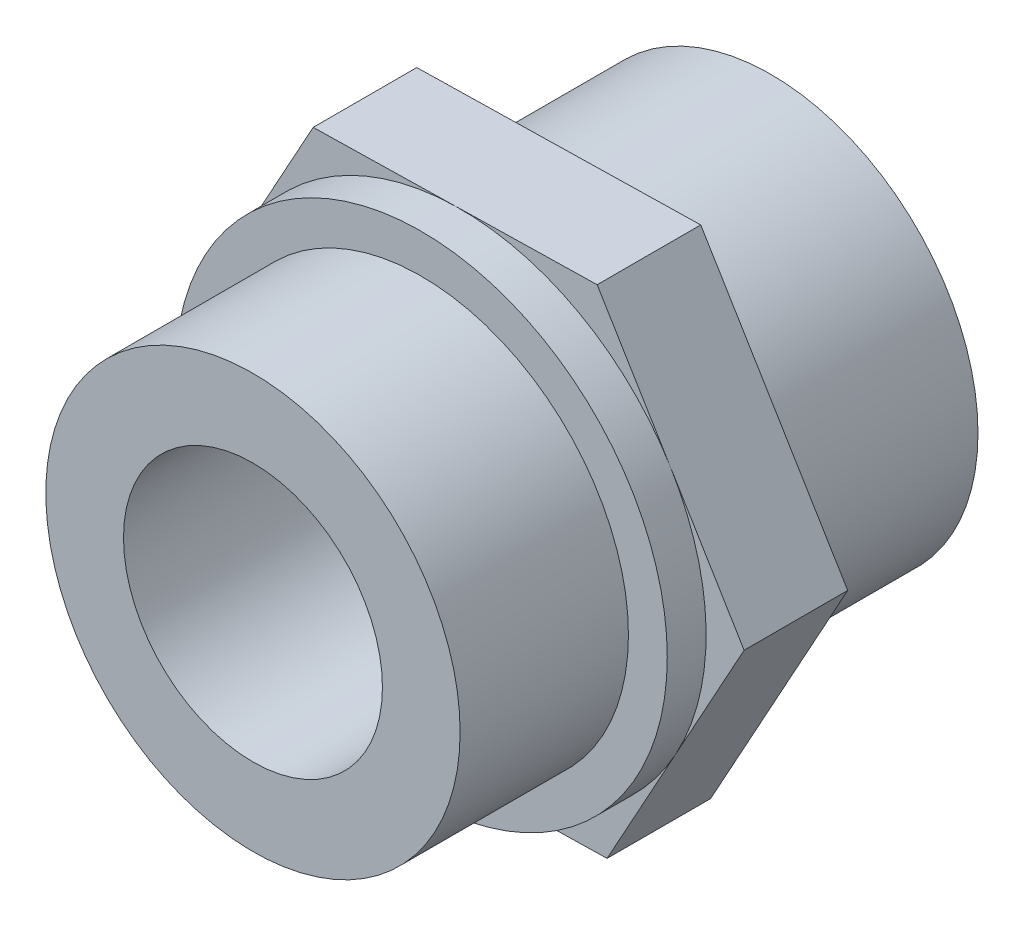
ISO-10303-21;
HEADER;
FILE_DESCRIPTION(('STEP AP214'),'2;1');
FILE_NAME('part.step','',(''),(''),'','','');
FILE_SCHEMA(('AUTOMOTIVE_DESIGN { 1 0 10303 214 1 1 1 1 }'));
ENDSEC;
DATA;
#1=APPLICATION_CONTEXT('core data for automotive mechanical design processes');
#2=APPLICATION_PROTOCOL_DEFINITION('international standard','automotive_design',2000,#1);
#3=PRODUCT_CONTEXT('',#1,'mechanical');
#4=PRODUCT('Part','Part','',(#3));
#5=PRODUCT_RELATED_PRODUCT_CATEGORY('part','',(#4));
#6=PRODUCT_DEFINITION_FORMATION('','',#4);
#7=PRODUCT_DEFINITION_CONTEXT('part definition',#1,'design');
#8=PRODUCT_DEFINITION('design','',#6,#7);
#9=PRODUCT_DEFINITION_SHAPE('','',#8);
#10=(LENGTH_UNIT() NAMED_UNIT(*) SI_UNIT(.MILLI.,.METRE.));
#11=(NAMED_UNIT(*) PLANE_ANGLE_UNIT() SI_UNIT($,.RADIAN.));
#12=(NAMED_UNIT(*) SI_UNIT($,.STERADIAN.) SOLID_ANGLE_UNIT());
#13=UNCERTAINTY_MEASURE_WITH_UNIT(LENGTH_MEASURE(1.E-05),#10,'distance_accuracy_value','');
#14=(GEOMETRIC_REPRESENTATION_CONTEXT(3) GLOBAL_UNCERTAINTY_ASSIGNED_CONTEXT((#13)) GLOBAL_UNIT_ASSIGNED_CONTEXT((#10,
#11,#12)) REPRESENTATION_CONTEXT('',''));
#15=CARTESIAN_POINT('',(0.,0.,0.));
#16=DIRECTION('',(0.,0.,1.));
#17=DIRECTION('',(1.,0.,0.));
#18=AXIS2_PLACEMENT_3D('',#15,#16,#17);
#19=CARTESIAN_POINT('',(0.,0.,4.));
#20=DIRECTION('',(0.,0.,1.));
#21=DIRECTION('',(1.,0.,0.));
#22=AXIS2_PLACEMENT_3D('',#19,#20,#21);
#23=PLANE('',#22);
#24=DIRECTION('',(0.482451119967932,0.875922894347264,0.));
#25=VECTOR('',#24,1.);
#26=CARTESIAN_POINT('',(5.67510629844794,-9.38757166868247,4.));
#27=LINE('',#26,#25);
#28=CARTESIAN_POINT('',(5.67510629844794,-9.38757166868247,4.));
#29=VERTEX_POINT('',#28);
#30=CARTESIAN_POINT('',(8.321267496299,-4.58328563969536,4.));
#31=VERTEX_POINT('',#30);
#32=EDGE_CURVE('E205',#29,#31,#27,.T.);
#33=ORIENTED_EDGE('',*,*,#32,.T.);
#34=CARTESIAN_POINT('',(0.,0.,4.));
#35=DIRECTION('',(0.,0.,1.));
#36=DIRECTION('',(1.,0.,0.));
#37=AXIS2_PLACEMENT_3D('',#34,#35,#36);
#38=CIRCLE('',#37,9.5);
#39=CARTESIAN_POINT('',(0.191391951372911,-9.49807186332835,4.));
#40=VERTEX_POINT('',#39);
#41=EDGE_CURVE('E57',#40,#31,#38,.T.);
#42=ORIENTED_EDGE('',*,*,#41,.F.);
#43=DIRECTION('',(0.999797038245089,0.0201465211971485,0.));
#44=VECTOR('',#43,1.);
#45=CARTESIAN_POINT('',(-5.29232239570213,-9.60857205797423,4.));
#46=LINE('',#45,#44);
#47=EDGE_CURVE('E102',#40,#29,#46,.T.);
#48=ORIENTED_EDGE('',*,*,#47,.T.);
#49=EDGE_LOOP('',(#33,#42,#48));
#50=FACE_BOUND('',#49,.T.);
#51=ADVANCED_FACE('F41',(#50),#23,.T.);
#52=CARTESIAN_POINT('',(-5.29232239570213,-9.60857205797423,4.));
#53=VERTEX_POINT('',#52);
#54=EDGE_CURVE('E210',#53,#40,#46,.T.);
#55=ORIENTED_EDGE('',*,*,#54,.T.);
#56=CARTESIAN_POINT('',(-8.12987554492609,-4.91478622363299,4.));
#57=VERTEX_POINT('',#56);
#58=EDGE_CURVE('E421',#57,#40,#38,.T.);
#59=ORIENTED_EDGE('',*,*,#58,.F.);
#60=DIRECTION('',(0.517345918277157,-0.855776373150115,0.));
#61=VECTOR('',#60,1.);
#62=CARTESIAN_POINT('',(-10.9674286941501,-0.221000389291756,4.));
#63=LINE('',#62,#61);
#64=EDGE_CURVE('E66',#57,#53,#63,.T.);
#65=ORIENTED_EDGE('',*,*,#64,.T.);
#66=EDGE_LOOP('',(#55,#59,#65));
#67=FACE_BOUND('',#66,.T.);
#68=ADVANCED_FACE('F250',(#67),#23,.T.);
#69=CARTESIAN_POINT('',(-10.9674286941501,-0.221000389291756,4.));
#70=VERTEX_POINT('',#69);
#71=EDGE_CURVE('E147',#70,#57,#63,.T.);
#72=ORIENTED_EDGE('',*,*,#71,.T.);
#73=CARTESIAN_POINT('',(-8.321267496299,4.58328563969536,4.));
#74=VERTEX_POINT('',#73);
#75=EDGE_CURVE('E189',#74,#57,#38,.T.);
#76=ORIENTED_EDGE('',*,*,#75,.F.);
#77=DIRECTION('',(-0.482451119967932,-0.875922894347264,0.));
#78=VECTOR('',#77,1.);
#79=CARTESIAN_POINT('',(-5.67510629844794,9.38757166868247,4.));
#80=LINE('',#79,#78);
#81=EDGE_CURVE('E145',#74,#70,#80,.T.);
#82=ORIENTED_EDGE('',*,*,#81,.T.);
#83=EDGE_LOOP('',(#72,#76,#82));
#84=FACE_BOUND('',#83,.T.);
#85=ADVANCED_FACE('F187',(#84),#23,.T.);
#86=CARTESIAN_POINT('',(-5.67510629844794,9.38757166868247,4.));
#87=VERTEX_POINT('',#86);
#88=EDGE_CURVE('E121',#87,#74,#80,.T.);
#89=ORIENTED_EDGE('',*,*,#88,.T.);
#90=CARTESIAN_POINT('',(-0.191391951372911,9.49807186332835,4.));
#91=VERTEX_POINT('',#90);
#92=EDGE_CURVE('E124',#91,#74,#38,.T.);
#93=ORIENTED_EDGE('',*,*,#92,.F.);
#94=DIRECTION('',(-0.999797038245089,-0.0201465211971485,0.));
#95=VECTOR('',#94,1.);
#96=CARTESIAN_POINT('',(5.29232239570212,9.60857205797423,4.));
#97=LINE('',#96,#95);
#98=EDGE_CURVE('E116',#91,#87,#97,.T.);
#99=ORIENTED_EDGE('',*,*,#98,.T.);
#100=EDGE_LOOP('',(#89,#93,#99));
#101=FACE_BOUND('',#100,.T.);
#102=ADVANCED_FACE('F118',(#101),#23,.T.);
#103=CARTESIAN_POINT('',(5.29232239570212,9.60857205797423,4.));
#104=VERTEX_POINT('',#103);
#105=EDGE_CURVE('E128',#104,#91,#97,.T.);
#106=ORIENTED_EDGE('',*,*,#105,.T.);
#107=CARTESIAN_POINT('',(8.12987554492609,4.91478622363299,4.));
#108=VERTEX_POINT('',#107);
#109=EDGE_CURVE('E198',#108,#91,#38,.T.);
#110=ORIENTED_EDGE('',*,*,#109,.F.);
#111=DIRECTION('',(-0.517345918277157,0.855776373150115,0.));
#112=VECTOR('',#111,1.);
#113=CARTESIAN_POINT('',(10.9674286941501,0.221000389291757,4.));
#114=LINE('',#113,#112);
#115=EDGE_CURVE('E203',#108,#104,#114,.T.);
#116=ORIENTED_EDGE('',*,*,#115,.T.);
#117=EDGE_LOOP('',(#106,#110,#116));
#118=FACE_BOUND('',#117,.T.);
#119=ADVANCED_FACE('F202',(#118),#23,.T.);
#120=CARTESIAN_POINT('',(-5.29232239570213,-9.60857205797423,4.));
#121=DIRECTION('',(-0.0201465211971485,0.99979703824509,0.));
#122=DIRECTION('',(-0.99979703824509,-0.0201465211971485,0.));
#123=AXIS2_PLACEMENT_3D('',#120,#121,#122);
#124=PLANE('',#123);
#125=DIRECTION('',(0.999797038245089,0.0201465211971485,0.));
#126=VECTOR('',#125,1.);
#127=CARTESIAN_POINT('',(-5.29232239570213,-9.60857205797423,0.));
#128=LINE('',#127,#126);
#129=CARTESIAN_POINT('',(-5.29232239570213,-9.60857205797423,0.));
#130=VERTEX_POINT('',#129);
#131=CARTESIAN_POINT('',(5.67510629844794,-9.38757166868247,0.));
#132=VERTEX_POINT('',#131);
#133=EDGE_CURVE('E153',#130,#132,#128,.T.);
#134=ORIENTED_EDGE('',*,*,#133,.T.);
#135=DIRECTION('',(0.,0.,-1.));
#136=VECTOR('',#135,1.);
#137=CARTESIAN_POINT('',(5.67510629844794,-9.38757166868247,4.));
#138=LINE('',#137,#136);
#139=EDGE_CURVE('E11',#29,#132,#138,.T.);
#140=ORIENTED_EDGE('',*,*,#139,.F.);
#141=ORIENTED_EDGE('',*,*,#47,.F.);
#142=ORIENTED_EDGE('',*,*,#54,.F.);
#143=DIRECTION('',(0.,0.,-1.));
#144=VECTOR('',#143,1.);
#145=CARTESIAN_POINT('',(-5.29232239570213,-9.60857205797423,4.));
#146=LINE('',#145,#144);
#147=EDGE_CURVE('E152',#53,#130,#146,.T.);
#148=ORIENTED_EDGE('',*,*,#147,.T.);
#149=EDGE_LOOP('',(#134,#140,#141,#142,#148));
#150=FACE_BOUND('',#149,.T.);
#151=ADVANCED_FACE('F43',(#150),#124,.F.);
#152=CARTESIAN_POINT('',(5.67510629844794,-9.38757166868247,4.));
#153=DIRECTION('',(-0.875922894347264,0.482451119967932,0.));
#154=DIRECTION('',(-0.482451119967932,-0.875922894347264,0.));
#155=AXIS2_PLACEMENT_3D('',#152,#153,#154);
#156=PLANE('',#155);
#157=DIRECTION('',(0.482451119967932,0.875922894347264,0.));
#158=VECTOR('',#157,1.);
#159=CARTESIAN_POINT('',(5.67510629844794,-9.38757166868247,0.));
#160=LINE('',#159,#158);
#161=CARTESIAN_POINT('',(10.9674286941501,0.221000389291757,0.));
#162=VERTEX_POINT('',#161);
#163=EDGE_CURVE('E156',#132,#162,#160,.T.);
#164=ORIENTED_EDGE('',*,*,#163,.T.);
#165=DIRECTION('',(0.,0.,-1.));
#166=VECTOR('',#165,1.);
#167=CARTESIAN_POINT('',(10.9674286941501,0.221000389291757,4.));
#168=LINE('',#167,#166);
#169=CARTESIAN_POINT('',(10.9674286941501,0.221000389291757,4.));
#170=VERTEX_POINT('',#169);
#171=EDGE_CURVE('E50',#170,#162,#168,.T.);
#172=ORIENTED_EDGE('',*,*,#171,.F.);
#173=EDGE_CURVE('E207',#31,#170,#27,.T.);
#174=ORIENTED_EDGE('',*,*,#173,.F.);
#175=ORIENTED_EDGE('',*,*,#32,.F.);
#176=ORIENTED_EDGE('',*,*,#139,.T.);
#177=EDGE_LOOP('',(#164,#172,#174,#175,#176));
#178=FACE_BOUND('',#177,.T.);
#179=ADVANCED_FACE('F269',(#178),#156,.F.);
#180=CARTESIAN_POINT('',(10.9674286941501,0.221000389291757,4.));
#181=DIRECTION('',(-0.855776373150115,-0.517345918277157,0.));
#182=DIRECTION('',(0.517345918277157,-0.855776373150115,0.));
#183=AXIS2_PLACEMENT_3D('',#180,#181,#182);
#184=PLANE('',#183);
#185=DIRECTION('',(-0.517345918277157,0.855776373150115,0.));
#186=VECTOR('',#185,1.);
#187=CARTESIAN_POINT('',(10.9674286941501,0.221000389291757,0.));
#188=LINE('',#187,#186);
#189=CARTESIAN_POINT('',(5.29232239570212,9.60857205797423,0.));
#190=VERTEX_POINT('',#189);
#191=EDGE_CURVE('E159',#162,#190,#188,.T.);
#192=ORIENTED_EDGE('',*,*,#191,.T.);
#193=DIRECTION('',(0.,0.,-1.));
#194=VECTOR('',#193,1.);
#195=CARTESIAN_POINT('',(5.29232239570212,9.60857205797423,4.));
#196=LINE('',#195,#194);
#197=EDGE_CURVE('E139',#104,#190,#196,.T.);
#198=ORIENTED_EDGE('',*,*,#197,.F.);
#199=ORIENTED_EDGE('',*,*,#115,.F.);
#200=EDGE_CURVE('E129',#170,#108,#114,.T.);
#201=ORIENTED_EDGE('',*,*,#200,.F.);
#202=ORIENTED_EDGE('',*,*,#171,.T.);
#203=EDGE_LOOP('',(#192,#198,#199,#201,#202));
#204=FACE_BOUND('',#203,.T.);
#205=ADVANCED_FACE('F173',(#204),#184,.F.);
#206=CARTESIAN_POINT('',(5.29232239570212,9.60857205797423,4.));
#207=DIRECTION('',(0.0201465211971485,-0.99979703824509,0.));
#208=DIRECTION('',(0.99979703824509,0.0201465211971485,0.));
#209=AXIS2_PLACEMENT_3D('',#206,#207,#208);
#210=PLANE('',#209);
#211=DIRECTION('',(-0.999797038245089,-0.0201465211971485,0.));
#212=VECTOR('',#211,1.);
#213=CARTESIAN_POINT('',(5.29232239570212,9.60857205797423,0.));
#214=LINE('',#213,#212);
#215=CARTESIAN_POINT('',(-5.67510629844794,9.38757166868247,0.));
#216=VERTEX_POINT('',#215);
#217=EDGE_CURVE('E136',#190,#216,#214,.T.);
#218=ORIENTED_EDGE('',*,*,#217,.T.);
#219=DIRECTION('',(0.,0.,-1.));
#220=VECTOR('',#219,1.);
#221=CARTESIAN_POINT('',(-5.67510629844794,9.38757166868247,4.));
#222=LINE('',#221,#220);
#223=EDGE_CURVE('E132',#87,#216,#222,.T.);
#224=ORIENTED_EDGE('',*,*,#223,.F.);
#225=ORIENTED_EDGE('',*,*,#98,.F.);
#226=ORIENTED_EDGE('',*,*,#105,.F.);
#227=ORIENTED_EDGE('',*,*,#197,.T.);
#228=EDGE_LOOP('',(#218,#224,#225,#226,#227));
#229=FACE_BOUND('',#228,.T.);
#230=ADVANCED_FACE('F133',(#229),#210,.F.);
#231=CARTESIAN_POINT('',(-5.67510629844794,9.38757166868247,4.));
#232=DIRECTION('',(0.875922894347264,-0.482451119967932,0.));
#233=DIRECTION('',(0.482451119967932,0.875922894347264,0.));
#234=AXIS2_PLACEMENT_3D('',#231,#232,#233);
#235=PLANE('',#234);
#236=DIRECTION('',(-0.482451119967932,-0.875922894347264,0.));
#237=VECTOR('',#236,1.);
#238=CARTESIAN_POINT('',(-5.67510629844794,9.38757166868247,0.));
#239=LINE('',#238,#237);
#240=CARTESIAN_POINT('',(-10.9674286941501,-0.221000389291756,0.));
#241=VERTEX_POINT('',#240);
#242=EDGE_CURVE('E162',#216,#241,#239,.T.);
#243=ORIENTED_EDGE('',*,*,#242,.T.);
#244=DIRECTION('',(0.,0.,-1.));
#245=VECTOR('',#244,1.);
#246=CARTESIAN_POINT('',(-10.9674286941501,-0.221000389291756,4.));
#247=LINE('',#246,#245);
#248=EDGE_CURVE('E140',#70,#241,#247,.T.);
#249=ORIENTED_EDGE('',*,*,#248,.F.);
#250=ORIENTED_EDGE('',*,*,#81,.F.);
#251=ORIENTED_EDGE('',*,*,#88,.F.);
#252=ORIENTED_EDGE('',*,*,#223,.T.);
#253=EDGE_LOOP('',(#243,#249,#250,#251,#252));
#254=FACE_BOUND('',#253,.T.);
#255=ADVANCED_FACE('F143',(#254),#235,.F.);
#256=CARTESIAN_POINT('',(-10.9674286941501,-0.221000389291756,4.));
#257=DIRECTION('',(0.855776373150115,0.517345918277157,0.));
#258=DIRECTION('',(-0.517345918277157,0.855776373150115,0.));
#259=AXIS2_PLACEMENT_3D('',#256,#257,#258);
#260=PLANE('',#259);
#261=DIRECTION('',(0.517345918277157,-0.855776373150115,0.));
#262=VECTOR('',#261,1.);
#263=CARTESIAN_POINT('',(-10.9674286941501,-0.221000389291756,0.));
#264=LINE('',#263,#262);
#265=EDGE_CURVE('E94',#241,#130,#264,.T.);
#266=ORIENTED_EDGE('',*,*,#265,.T.);
#267=ORIENTED_EDGE('',*,*,#147,.F.);
#268=ORIENTED_EDGE('',*,*,#64,.F.);
#269=ORIENTED_EDGE('',*,*,#71,.F.);
#270=ORIENTED_EDGE('',*,*,#248,.T.);
#271=EDGE_LOOP('',(#266,#267,#268,#269,#270));
#272=FACE_BOUND('',#271,.T.);
#273=ADVANCED_FACE('F183',(#272),#260,.F.);
#274=ORIENTED_EDGE('',*,*,#200,.T.);
#275=EDGE_CURVE('E195',#31,#108,#38,.T.);
#276=ORIENTED_EDGE('',*,*,#275,.F.);
#277=ORIENTED_EDGE('',*,*,#173,.T.);
#278=EDGE_LOOP('',(#274,#276,#277));
#279=FACE_BOUND('',#278,.T.);
#280=ADVANCED_FACE('F206',(#279),#23,.T.);
#281=CARTESIAN_POINT('',(0.,0.,0.));
#282=DIRECTION('',(0.,0.,1.));
#283=DIRECTION('',(1.,0.,0.));
#284=AXIS2_PLACEMENT_3D('',#281,#282,#283);
#285=PLANE('',#284);
#286=CARTESIAN_POINT('',(0.,0.,0.));
#287=DIRECTION('',(0.,0.,1.));
#288=DIRECTION('',(1.,0.,0.));
#289=AXIS2_PLACEMENT_3D('',#286,#287,#288);
#290=CIRCLE('',#289,8.);
#291=CARTESIAN_POINT('',(8.,0.,0.));
#292=VERTEX_POINT('',#291);
#293=EDGE_CURVE('E218',#292,#292,#290,.T.);
#294=ORIENTED_EDGE('',*,*,#293,.T.);
#295=EDGE_LOOP('',(#294));
#296=FACE_BOUND('',#295,.T.);
#297=ORIENTED_EDGE('',*,*,#133,.F.);
#298=ORIENTED_EDGE('',*,*,#265,.F.);
#299=ORIENTED_EDGE('',*,*,#242,.F.);
#300=ORIENTED_EDGE('',*,*,#217,.F.);
#301=ORIENTED_EDGE('',*,*,#191,.F.);
#302=ORIENTED_EDGE('',*,*,#163,.F.);
#303=EDGE_LOOP('',(#297,#298,#299,#300,#301,#302));
#304=FACE_BOUND('',#303,.T.);
#305=ADVANCED_FACE('F181',(#296,#304),#285,.F.);
#306=CARTESIAN_POINT('',(0.,0.,-8.));
#307=DIRECTION('',(0.,0.,1.));
#308=DIRECTION('',(1.,0.,0.));
#309=AXIS2_PLACEMENT_3D('',#306,#307,#308);
#310=CYLINDRICAL_SURFACE('',#309,8.);
#311=CARTESIAN_POINT('',(0.,0.,-8.));
#312=DIRECTION('',(0.,0.,1.));
#313=DIRECTION('',(1.,0.,0.));
#314=AXIS2_PLACEMENT_3D('',#311,#312,#313);
#315=CIRCLE('',#314,8.);
#316=CARTESIAN_POINT('',(8.,0.,-8.));
#317=VERTEX_POINT('',#316);
#318=EDGE_CURVE('E217',#317,#317,#315,.T.);
#319=ORIENTED_EDGE('',*,*,#318,.T.);
#320=EDGE_LOOP('',(#319));
#321=FACE_BOUND('',#320,.T.);
#322=ORIENTED_EDGE('',*,*,#293,.F.);
#323=EDGE_LOOP('',(#322));
#324=FACE_BOUND('',#323,.T.);
#325=ADVANCED_FACE('F246',(#321,#324),#310,.T.);
#326=CARTESIAN_POINT('',(0.,0.,-8.));
#327=DIRECTION('',(0.,0.,-1.));
#328=DIRECTION('',(1.,0.,0.));
#329=AXIS2_PLACEMENT_3D('',#326,#327,#328);
#330=PLANE('',#329);
#331=CARTESIAN_POINT('',(0.,0.,-8.));
#332=DIRECTION('',(0.,0.,-1.));
#333=DIRECTION('',(-1.,0.,0.));
#334=AXIS2_PLACEMENT_3D('',#331,#332,#333);
#335=CIRCLE('',#334,5.);
#336=CARTESIAN_POINT('',(-5.,0.,-8.));
#337=VERTEX_POINT('',#336);
#338=EDGE_CURVE('E221',#337,#337,#335,.T.);
#339=ORIENTED_EDGE('',*,*,#338,.F.);
#340=EDGE_LOOP('',(#339));
#341=FACE_BOUND('',#340,.T.);
#342=ORIENTED_EDGE('',*,*,#318,.F.);
#343=EDGE_LOOP('',(#342));
#344=FACE_BOUND('',#343,.T.);
#345=ADVANCED_FACE('F237',(#341,#344),#330,.T.);
#346=CARTESIAN_POINT('',(0.,0.,5.5));
#347=DIRECTION('',(0.,0.,1.));
#348=DIRECTION('',(1.,0.,0.));
#349=AXIS2_PLACEMENT_3D('',#346,#347,#348);
#350=PLANE('',#349);
#351=CARTESIAN_POINT('',(0.,0.,5.5));
#352=DIRECTION('',(0.,0.,1.));
#353=DIRECTION('',(1.,0.,0.));
#354=AXIS2_PLACEMENT_3D('',#351,#352,#353);
#355=CIRCLE('',#354,8.);
#356=CARTESIAN_POINT('',(8.,0.,5.5));
#357=VERTEX_POINT('',#356);
#358=EDGE_CURVE('E45',#357,#357,#355,.T.);
#359=ORIENTED_EDGE('',*,*,#358,.F.);
#360=EDGE_LOOP('',(#359));
#361=FACE_BOUND('',#360,.T.);
#362=CARTESIAN_POINT('',(0.,0.,5.5));
#363=DIRECTION('',(0.,0.,1.));
#364=DIRECTION('',(1.,0.,0.));
#365=AXIS2_PLACEMENT_3D('',#362,#363,#364);
#366=CIRCLE('',#365,9.5);
#367=CARTESIAN_POINT('',(9.5,0.,5.5));
#368=VERTEX_POINT('',#367);
#369=EDGE_CURVE('E204',#368,#368,#366,.T.);
#370=ORIENTED_EDGE('',*,*,#369,.T.);
#371=EDGE_LOOP('',(#370));
#372=FACE_BOUND('',#371,.T.);
#373=ADVANCED_FACE('F235',(#361,#372),#350,.T.);
#374=CARTESIAN_POINT('',(0.,0.,5.5));
#375=DIRECTION('',(0.,0.,-1.));
#376=DIRECTION('',(-1.,0.,0.));
#377=AXIS2_PLACEMENT_3D('',#374,#375,#376);
#378=CYLINDRICAL_SURFACE('',#377,9.5);
#379=ORIENTED_EDGE('',*,*,#369,.F.);
#380=EDGE_LOOP('',(#379));
#381=FACE_BOUND('',#380,.T.);
#382=ORIENTED_EDGE('',*,*,#109,.T.);
#383=ORIENTED_EDGE('',*,*,#92,.T.);
#384=ORIENTED_EDGE('',*,*,#75,.T.);
#385=ORIENTED_EDGE('',*,*,#58,.T.);
#386=ORIENTED_EDGE('',*,*,#41,.T.);
#387=ORIENTED_EDGE('',*,*,#275,.T.);
#388=EDGE_LOOP('',(#382,#383,#384,#385,#386,#387));
#389=FACE_BOUND('',#388,.T.);
#390=ADVANCED_FACE('F197',(#381,#389),#378,.T.);
#391=CARTESIAN_POINT('',(0.,0.,0.));
#392=DIRECTION('',(0.,0.,1.));
#393=DIRECTION('',(1.,0.,0.));
#394=AXIS2_PLACEMENT_3D('',#391,#392,#393);
#395=CYLINDRICAL_SURFACE('',#394,5.);
#396=CARTESIAN_POINT('',(0.,0.,12.));
#397=DIRECTION('',(0.,0.,1.));
#398=DIRECTION('',(1.,0.,0.));
#399=AXIS2_PLACEMENT_3D('',#396,#397,#398);
#400=CIRCLE('',#399,5.);
#401=CARTESIAN_POINT('',(5.,0.,12.));
#402=VERTEX_POINT('',#401);
#403=EDGE_CURVE('E214',#402,#402,#400,.T.);
#404=ORIENTED_EDGE('',*,*,#403,.T.);
#405=EDGE_LOOP('',(#404));
#406=FACE_BOUND('',#405,.T.);
#407=ORIENTED_EDGE('',*,*,#338,.T.);
#408=EDGE_LOOP('',(#407));
#409=FACE_BOUND('',#408,.T.);
#410=ADVANCED_FACE('F243',(#406,#409),#395,.F.);
#411=CARTESIAN_POINT('',(0.,0.,12.));
#412=DIRECTION('',(0.,0.,1.));
#413=DIRECTION('',(1.,0.,0.));
#414=AXIS2_PLACEMENT_3D('',#411,#412,#413);
#415=PLANE('',#414);
#416=ORIENTED_EDGE('',*,*,#403,.F.);
#417=EDGE_LOOP('',(#416));
#418=FACE_BOUND('',#417,.T.);
#419=CARTESIAN_POINT('',(0.,0.,12.));
#420=DIRECTION('',(0.,0.,1.));
#421=DIRECTION('',(1.,0.,0.));
#422=AXIS2_PLACEMENT_3D('',#419,#420,#421);
#423=CIRCLE('',#422,8.);
#424=CARTESIAN_POINT('',(8.,0.,12.));
#425=VERTEX_POINT('',#424);
#426=EDGE_CURVE('E157',#425,#425,#423,.T.);
#427=ORIENTED_EDGE('',*,*,#426,.T.);
#428=EDGE_LOOP('',(#427));
#429=FACE_BOUND('',#428,.T.);
#430=ADVANCED_FACE('F317',(#418,#429),#415,.T.);
#431=CARTESIAN_POINT('',(0.,0.,12.));
#432=DIRECTION('',(0.,0.,-1.));
#433=DIRECTION('',(-1.,0.,0.));
#434=AXIS2_PLACEMENT_3D('',#431,#432,#433);
#435=CYLINDRICAL_SURFACE('',#434,8.);
#436=ORIENTED_EDGE('',*,*,#358,.T.);
#437=EDGE_LOOP('',(#436));
#438=FACE_BOUND('',#437,.T.);
#439=ORIENTED_EDGE('',*,*,#426,.F.);
#440=EDGE_LOOP('',(#439));
#441=FACE_BOUND('',#440,.T.);
#442=ADVANCED_FACE('F232',(#438,#441),#435,.T.);
#443=CLOSED_SHELL('',(#51,#68,#85,#102,#119,#151,#179,#205,#230,#255,#273,#280,#305,#325,#345,
#373,#390,#410,#430,#442));
#444=MANIFOLD_SOLID_BREP('B2',#443);
#445=ADVANCED_BREP_SHAPE_REPRESENTATION('',(#18,#444),#14);
#446=SHAPE_DEFINITION_REPRESENTATION(#9,#445);
ENDSEC;
END-ISO-10303-21;
